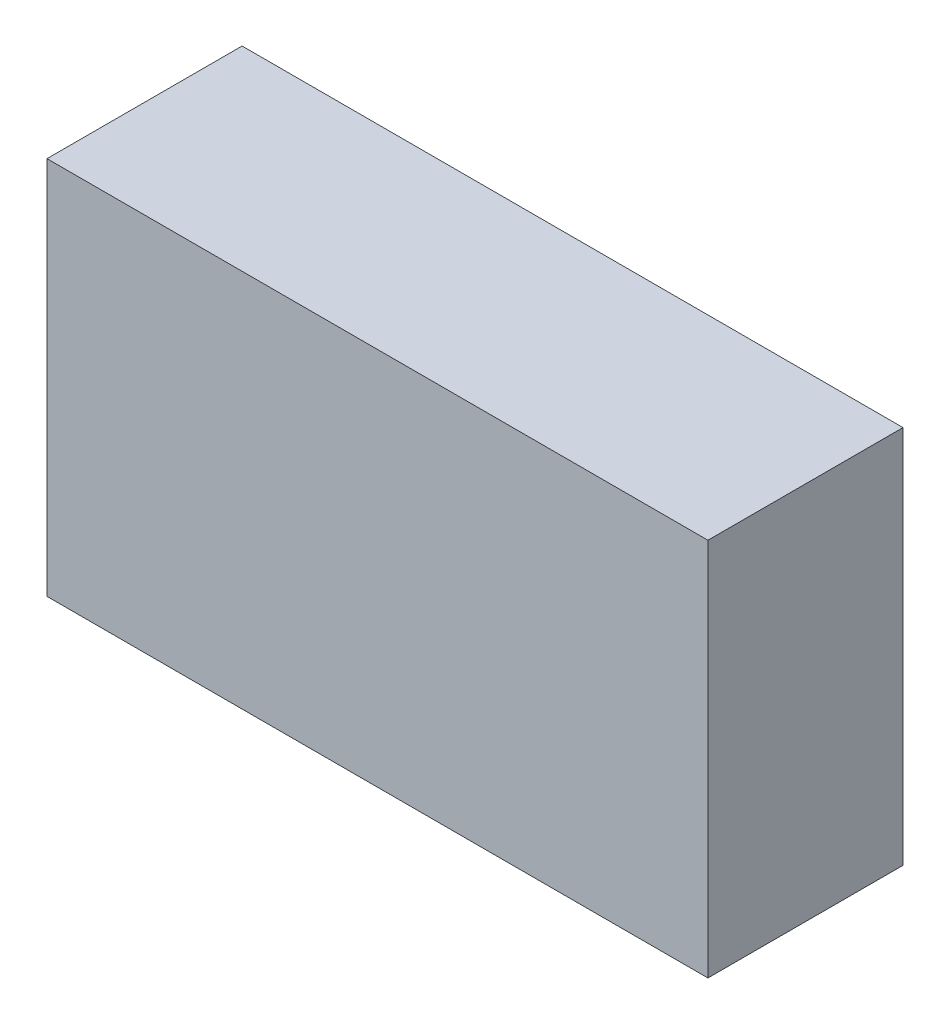
ISO-10303-21;
HEADER;
FILE_DESCRIPTION(('STEP AP214'),'2;1');
FILE_NAME('part.step','',(''),(''),'','','');
FILE_SCHEMA(('AUTOMOTIVE_DESIGN { 1 0 10303 214 1 1 1 1 }'));
ENDSEC;
DATA;
#1=APPLICATION_CONTEXT('core data for automotive mechanical design processes');
#2=APPLICATION_PROTOCOL_DEFINITION('international standard','automotive_design',2000,#1);
#3=PRODUCT_CONTEXT('',#1,'mechanical');
#4=PRODUCT('Part','Part','',(#3));
#5=PRODUCT_RELATED_PRODUCT_CATEGORY('part','',(#4));
#6=PRODUCT_DEFINITION_FORMATION('','',#4);
#7=PRODUCT_DEFINITION_CONTEXT('part definition',#1,'design');
#8=PRODUCT_DEFINITION('design','',#6,#7);
#9=PRODUCT_DEFINITION_SHAPE('','',#8);
#10=(LENGTH_UNIT() NAMED_UNIT(*) SI_UNIT(.MILLI.,.METRE.));
#11=(NAMED_UNIT(*) PLANE_ANGLE_UNIT() SI_UNIT($,.RADIAN.));
#12=(NAMED_UNIT(*) SI_UNIT($,.STERADIAN.) SOLID_ANGLE_UNIT());
#13=UNCERTAINTY_MEASURE_WITH_UNIT(LENGTH_MEASURE(1.E-05),#10,'distance_accuracy_value','');
#14=(GEOMETRIC_REPRESENTATION_CONTEXT(3) GLOBAL_UNCERTAINTY_ASSIGNED_CONTEXT((#13)) GLOBAL_UNIT_ASSIGNED_CONTEXT((#10,
#11,#12)) REPRESENTATION_CONTEXT('',''));
#15=CARTESIAN_POINT('',(0.,0.,0.));
#16=DIRECTION('',(0.,0.,1.));
#17=DIRECTION('',(1.,0.,0.));
#18=AXIS2_PLACEMENT_3D('',#15,#16,#17);
#19=CARTESIAN_POINT('',(1.52449276,0.87449152,0.90000074));
#20=DIRECTION('',(0.,0.,1.));
#21=DIRECTION('',(1.,0.,0.));
#22=AXIS2_PLACEMENT_3D('',#19,#20,#21);
#23=PLANE('',#22);
#24=DIRECTION('',(1.,0.,0.));
#25=VECTOR('',#24,1.);
#26=CARTESIAN_POINT('',(-1.52449276,0.87449152,0.90000074));
#27=LINE('',#26,#25);
#28=CARTESIAN_POINT('',(-1.52449276,0.87449152,0.90000074));
#29=VERTEX_POINT('',#28);
#30=CARTESIAN_POINT('',(1.52449276,0.87449152,0.90000074));
#31=VERTEX_POINT('',#30);
#32=EDGE_CURVE('E21',#29,#31,#27,.T.);
#33=ORIENTED_EDGE('',*,*,#32,.F.);
#34=DIRECTION('',(0.,1.,0.));
#35=VECTOR('',#34,1.);
#36=CARTESIAN_POINT('',(-1.52449276,-0.87449152,0.90000074));
#37=LINE('',#36,#35);
#38=CARTESIAN_POINT('',(-1.52449276,-0.87449152,0.90000074));
#39=VERTEX_POINT('',#38);
#40=EDGE_CURVE('E73',#39,#29,#37,.T.);
#41=ORIENTED_EDGE('',*,*,#40,.F.);
#42=DIRECTION('',(-1.,0.,0.));
#43=VECTOR('',#42,1.);
#44=CARTESIAN_POINT('',(1.52449276,-0.87449152,0.90000074));
#45=LINE('',#44,#43);
#46=CARTESIAN_POINT('',(1.52449276,-0.87449152,0.90000074));
#47=VERTEX_POINT('',#46);
#48=EDGE_CURVE('E76',#47,#39,#45,.T.);
#49=ORIENTED_EDGE('',*,*,#48,.F.);
#50=DIRECTION('',(0.,-1.,0.));
#51=VECTOR('',#50,1.);
#52=CARTESIAN_POINT('',(1.52449276,0.87449152,0.90000074));
#53=LINE('',#52,#51);
#54=EDGE_CURVE('E114',#31,#47,#53,.T.);
#55=ORIENTED_EDGE('',*,*,#54,.F.);
#56=EDGE_LOOP('',(#33,#41,#49,#55));
#57=FACE_BOUND('',#56,.T.);
#58=ADVANCED_FACE('F17',(#57),#23,.T.);
#59=CARTESIAN_POINT('',(1.52449276,0.87449152,0.));
#60=DIRECTION('',(0.,0.,1.));
#61=DIRECTION('',(1.,0.,0.));
#62=AXIS2_PLACEMENT_3D('',#59,#60,#61);
#63=PLANE('',#62);
#64=DIRECTION('',(0.,-1.,0.));
#65=VECTOR('',#64,1.);
#66=CARTESIAN_POINT('',(1.52449276,0.87449152,0.));
#67=LINE('',#66,#65);
#68=CARTESIAN_POINT('',(1.52449276,0.87449152,0.));
#69=VERTEX_POINT('',#68);
#70=CARTESIAN_POINT('',(1.52449276,-0.87449152,0.));
#71=VERTEX_POINT('',#70);
#72=EDGE_CURVE('E93',#69,#71,#67,.T.);
#73=ORIENTED_EDGE('',*,*,#72,.T.);
#74=DIRECTION('',(-1.,0.,0.));
#75=VECTOR('',#74,1.);
#76=CARTESIAN_POINT('',(1.52449276,-0.87449152,0.));
#77=LINE('',#76,#75);
#78=CARTESIAN_POINT('',(-1.52449276,-0.87449152,0.));
#79=VERTEX_POINT('',#78);
#80=EDGE_CURVE('E80',#71,#79,#77,.T.);
#81=ORIENTED_EDGE('',*,*,#80,.T.);
#82=DIRECTION('',(0.,1.,0.));
#83=VECTOR('',#82,1.);
#84=CARTESIAN_POINT('',(-1.52449276,-0.87449152,0.));
#85=LINE('',#84,#83);
#86=CARTESIAN_POINT('',(-1.52449276,0.87449152,0.));
#87=VERTEX_POINT('',#86);
#88=EDGE_CURVE('E66',#79,#87,#85,.T.);
#89=ORIENTED_EDGE('',*,*,#88,.T.);
#90=DIRECTION('',(1.,0.,0.));
#91=VECTOR('',#90,1.);
#92=CARTESIAN_POINT('',(-1.52449276,0.87449152,0.));
#93=LINE('',#92,#91);
#94=EDGE_CURVE('E11',#87,#69,#93,.T.);
#95=ORIENTED_EDGE('',*,*,#94,.T.);
#96=EDGE_LOOP('',(#73,#81,#89,#95));
#97=FACE_BOUND('',#96,.T.);
#98=ADVANCED_FACE('F19',(#97),#63,.F.);
#99=CARTESIAN_POINT('',(-1.52449276,0.87449152,0.));
#100=DIRECTION('',(0.,1.,0.));
#101=DIRECTION('',(1.,0.,0.));
#102=AXIS2_PLACEMENT_3D('',#99,#100,#101);
#103=PLANE('',#102);
#104=DIRECTION('',(0.,0.,1.));
#105=VECTOR('',#104,1.);
#106=CARTESIAN_POINT('',(-1.52449276,0.87449152,0.));
#107=LINE('',#106,#105);
#108=EDGE_CURVE('E79',#87,#29,#107,.T.);
#109=ORIENTED_EDGE('',*,*,#108,.T.);
#110=ORIENTED_EDGE('',*,*,#32,.T.);
#111=DIRECTION('',(0.,0.,1.));
#112=VECTOR('',#111,1.);
#113=CARTESIAN_POINT('',(1.52449276,0.87449152,0.));
#114=LINE('',#113,#112);
#115=EDGE_CURVE('E113',#69,#31,#114,.T.);
#116=ORIENTED_EDGE('',*,*,#115,.F.);
#117=ORIENTED_EDGE('',*,*,#94,.F.);
#118=EDGE_LOOP('',(#109,#110,#116,#117));
#119=FACE_BOUND('',#118,.T.);
#120=ADVANCED_FACE('F111',(#119),#103,.T.);
#121=CARTESIAN_POINT('',(-1.52449276,-0.87449152,0.));
#122=DIRECTION('',(-1.,0.,0.));
#123=DIRECTION('',(0.,0.,1.));
#124=AXIS2_PLACEMENT_3D('',#121,#122,#123);
#125=PLANE('',#124);
#126=DIRECTION('',(0.,0.,1.));
#127=VECTOR('',#126,1.);
#128=CARTESIAN_POINT('',(-1.52449276,-0.87449152,0.));
#129=LINE('',#128,#127);
#130=EDGE_CURVE('E83',#79,#39,#129,.T.);
#131=ORIENTED_EDGE('',*,*,#130,.T.);
#132=ORIENTED_EDGE('',*,*,#40,.T.);
#133=ORIENTED_EDGE('',*,*,#108,.F.);
#134=ORIENTED_EDGE('',*,*,#88,.F.);
#135=EDGE_LOOP('',(#131,#132,#133,#134));
#136=FACE_BOUND('',#135,.T.);
#137=ADVANCED_FACE('F84',(#136),#125,.T.);
#138=CARTESIAN_POINT('',(1.52449276,-0.87449152,0.));
#139=DIRECTION('',(0.,-1.,0.));
#140=DIRECTION('',(0.,0.,-1.));
#141=AXIS2_PLACEMENT_3D('',#138,#139,#140);
#142=PLANE('',#141);
#143=DIRECTION('',(0.,0.,1.));
#144=VECTOR('',#143,1.);
#145=CARTESIAN_POINT('',(1.52449276,-0.87449152,0.));
#146=LINE('',#145,#144);
#147=EDGE_CURVE('E90',#71,#47,#146,.T.);
#148=ORIENTED_EDGE('',*,*,#147,.T.);
#149=ORIENTED_EDGE('',*,*,#48,.T.);
#150=ORIENTED_EDGE('',*,*,#130,.F.);
#151=ORIENTED_EDGE('',*,*,#80,.F.);
#152=EDGE_LOOP('',(#148,#149,#150,#151));
#153=FACE_BOUND('',#152,.T.);
#154=ADVANCED_FACE('F88',(#153),#142,.T.);
#155=CARTESIAN_POINT('',(1.52449276,0.87449152,0.));
#156=DIRECTION('',(1.,0.,0.));
#157=DIRECTION('',(0.,1.,0.));
#158=AXIS2_PLACEMENT_3D('',#155,#156,#157);
#159=PLANE('',#158);
#160=ORIENTED_EDGE('',*,*,#115,.T.);
#161=ORIENTED_EDGE('',*,*,#54,.T.);
#162=ORIENTED_EDGE('',*,*,#147,.F.);
#163=ORIENTED_EDGE('',*,*,#72,.F.);
#164=EDGE_LOOP('',(#160,#161,#162,#163));
#165=FACE_BOUND('',#164,.T.);
#166=ADVANCED_FACE('F118',(#165),#159,.T.);
#167=CLOSED_SHELL('',(#58,#98,#120,#137,#154,#166));
#168=MANIFOLD_SOLID_BREP('B1',#167);
#169=ADVANCED_BREP_SHAPE_REPRESENTATION('',(#18,#168),#14);
#170=SHAPE_DEFINITION_REPRESENTATION(#9,#169);
ENDSEC;
END-ISO-10303-21;
